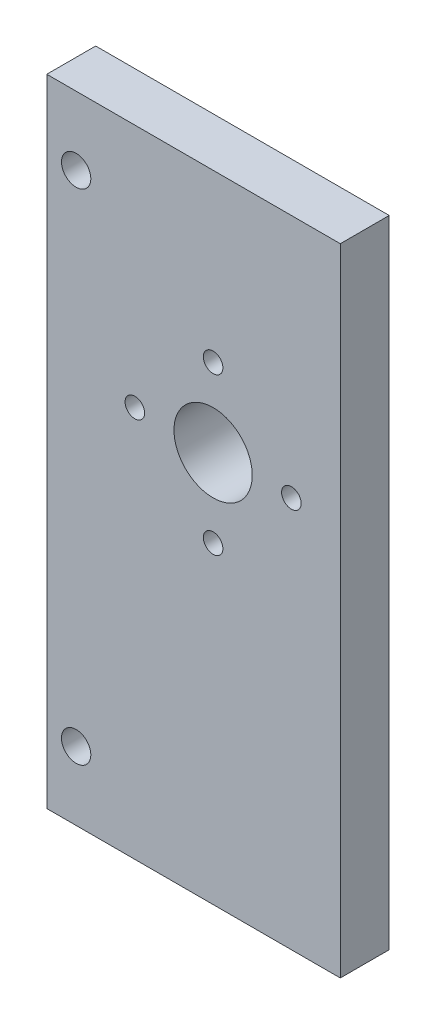
ISO-10303-21;
HEADER;
FILE_DESCRIPTION(('STEP AP214'),'2;1');
FILE_NAME('part.step','',(''),(''),'','','');
FILE_SCHEMA(('AUTOMOTIVE_DESIGN { 1 0 10303 214 1 1 1 1 }'));
ENDSEC;
DATA;
#1=APPLICATION_CONTEXT('core data for automotive mechanical design processes');
#2=APPLICATION_PROTOCOL_DEFINITION('international standard','automotive_design',2000,#1);
#3=PRODUCT_CONTEXT('',#1,'mechanical');
#4=PRODUCT('Part','Part','',(#3));
#5=PRODUCT_RELATED_PRODUCT_CATEGORY('part','',(#4));
#6=PRODUCT_DEFINITION_FORMATION('','',#4);
#7=PRODUCT_DEFINITION_CONTEXT('part definition',#1,'design');
#8=PRODUCT_DEFINITION('design','',#6,#7);
#9=PRODUCT_DEFINITION_SHAPE('','',#8);
#10=(LENGTH_UNIT() NAMED_UNIT(*) SI_UNIT(.MILLI.,.METRE.));
#11=(NAMED_UNIT(*) PLANE_ANGLE_UNIT() SI_UNIT($,.RADIAN.));
#12=(NAMED_UNIT(*) SI_UNIT($,.STERADIAN.) SOLID_ANGLE_UNIT());
#13=UNCERTAINTY_MEASURE_WITH_UNIT(LENGTH_MEASURE(1.E-05),#10,'distance_accuracy_value','');
#14=(GEOMETRIC_REPRESENTATION_CONTEXT(3) GLOBAL_UNCERTAINTY_ASSIGNED_CONTEXT((#13)) GLOBAL_UNIT_ASSIGNED_CONTEXT((#10,
#11,#12)) REPRESENTATION_CONTEXT('',''));
#15=CARTESIAN_POINT('',(0.,0.,0.));
#16=DIRECTION('',(0.,0.,1.));
#17=DIRECTION('',(1.,0.,0.));
#18=AXIS2_PLACEMENT_3D('',#15,#16,#17);
#19=CARTESIAN_POINT('',(0.,0.,0.));
#20=DIRECTION('',(0.,0.,-1.));
#21=DIRECTION('',(-1.,0.,0.));
#22=AXIS2_PLACEMENT_3D('',#19,#20,#21);
#23=PLANE('',#22);
#24=CARTESIAN_POINT('',(42.3645680316484,-75.6707452631833,0.));
#25=DIRECTION('',(0.,0.,1.));
#26=DIRECTION('',(1.,0.,0.));
#27=AXIS2_PLACEMENT_3D('',#24,#25,#26);
#28=CIRCLE('',#27,4.00000000000001);
#29=CARTESIAN_POINT('',(46.3645680316484,-75.6707452631833,0.));
#30=VERTEX_POINT('',#29);
#31=EDGE_CURVE('E122',#30,#30,#28,.T.);
#32=ORIENTED_EDGE('',*,*,#31,.T.);
#33=EDGE_LOOP('',(#32));
#34=FACE_BOUND('',#33,.T.);
#35=CARTESIAN_POINT('',(50.3645680316483,-75.6707452631833,0.));
#36=DIRECTION('',(0.,0.,1.));
#37=DIRECTION('',(1.,0.,0.));
#38=AXIS2_PLACEMENT_3D('',#35,#36,#37);
#39=CIRCLE('',#38,0.999999999999998);
#40=CARTESIAN_POINT('',(51.3645680316483,-75.6707452631833,0.));
#41=VERTEX_POINT('',#40);
#42=EDGE_CURVE('E132',#41,#41,#39,.T.);
#43=ORIENTED_EDGE('',*,*,#42,.T.);
#44=EDGE_LOOP('',(#43));
#45=FACE_BOUND('',#44,.T.);
#46=CARTESIAN_POINT('',(34.3645680316483,-75.6707452631833,0.));
#47=DIRECTION('',(0.,0.,1.));
#48=DIRECTION('',(1.,0.,0.));
#49=AXIS2_PLACEMENT_3D('',#46,#47,#48);
#50=CIRCLE('',#49,0.999999999999998);
#51=CARTESIAN_POINT('',(35.3645680316483,-75.6707452631833,0.));
#52=VERTEX_POINT('',#51);
#53=EDGE_CURVE('E144',#52,#52,#50,.T.);
#54=ORIENTED_EDGE('',*,*,#53,.T.);
#55=EDGE_LOOP('',(#54));
#56=FACE_BOUND('',#55,.T.);
#57=CARTESIAN_POINT('',(42.3645680316484,-67.6707452631833,0.));
#58=DIRECTION('',(0.,0.,1.));
#59=DIRECTION('',(1.,0.,0.));
#60=AXIS2_PLACEMENT_3D('',#57,#58,#59);
#61=CIRCLE('',#60,0.999999999999998);
#62=CARTESIAN_POINT('',(43.3645680316484,-67.6707452631833,0.));
#63=VERTEX_POINT('',#62);
#64=EDGE_CURVE('E138',#63,#63,#61,.T.);
#65=ORIENTED_EDGE('',*,*,#64,.T.);
#66=EDGE_LOOP('',(#65));
#67=FACE_BOUND('',#66,.T.);
#68=CARTESIAN_POINT('',(42.3645680316484,-83.6707452631833,0.));
#69=DIRECTION('',(0.,0.,1.));
#70=DIRECTION('',(1.,0.,0.));
#71=AXIS2_PLACEMENT_3D('',#68,#69,#70);
#72=CIRCLE('',#71,0.999999999999998);
#73=CARTESIAN_POINT('',(43.3645680316484,-83.6707452631833,0.));
#74=VERTEX_POINT('',#73);
#75=EDGE_CURVE('E126',#74,#74,#72,.T.);
#76=ORIENTED_EDGE('',*,*,#75,.T.);
#77=EDGE_LOOP('',(#76));
#78=FACE_BOUND('',#77,.T.);
#79=CARTESIAN_POINT('',(42.3645680316484,-75.6707452631833,0.));
#80=DIRECTION('',(0.,0.,-1.));
#81=DIRECTION('',(-1.,0.,0.));
#82=AXIS2_PLACEMENT_3D('',#79,#80,#81);
#83=CIRCLE('',#82,10.5);
#84=CARTESIAN_POINT('',(31.8645680316484,-75.6707452631833,0.));
#85=VERTEX_POINT('',#84);
#86=EDGE_CURVE('E191',#85,#85,#83,.T.);
#87=ORIENTED_EDGE('',*,*,#86,.T.);
#88=EDGE_LOOP('',(#87));
#89=FACE_BOUND('',#88,.T.);
#90=ADVANCED_FACE('F33',(#34,#45,#56,#67,#78,#89),#23,.T.);
#91=CARTESIAN_POINT('',(55.3645680316484,-115.670745263183,6.));
#92=DIRECTION('',(0.,1.,0.));
#93=DIRECTION('',(-1.,0.,0.));
#94=AXIS2_PLACEMENT_3D('',#91,#92,#93);
#95=PLANE('',#94);
#96=DIRECTION('',(-1.,0.,0.));
#97=VECTOR('',#96,1.);
#98=CARTESIAN_POINT('',(55.3645680316484,-115.670745263183,1.));
#99=LINE('',#98,#97);
#100=CARTESIAN_POINT('',(55.3645680316484,-115.670745263183,1.));
#101=VERTEX_POINT('',#100);
#102=CARTESIAN_POINT('',(25.3645680316484,-115.670745263183,1.));
#103=VERTEX_POINT('',#102);
#104=EDGE_CURVE('E49',#101,#103,#99,.T.);
#105=ORIENTED_EDGE('',*,*,#104,.F.);
#106=DIRECTION('',(0.,0.,-1.));
#107=VECTOR('',#106,1.);
#108=CARTESIAN_POINT('',(55.3645680316484,-115.670745263183,6.));
#109=LINE('',#108,#107);
#110=CARTESIAN_POINT('',(55.3645680316484,-115.670745263183,6.));
#111=VERTEX_POINT('',#110);
#112=EDGE_CURVE('E11',#111,#101,#109,.T.);
#113=ORIENTED_EDGE('',*,*,#112,.F.);
#114=DIRECTION('',(1.,0.,0.));
#115=VECTOR('',#114,1.);
#116=CARTESIAN_POINT('',(55.3645680316484,-115.670745263183,6.));
#117=LINE('',#116,#115);
#118=CARTESIAN_POINT('',(25.3645680316484,-115.670745263183,6.));
#119=VERTEX_POINT('',#118);
#120=EDGE_CURVE('E94',#119,#111,#117,.T.);
#121=ORIENTED_EDGE('',*,*,#120,.F.);
#122=DIRECTION('',(0.,0.,-1.));
#123=VECTOR('',#122,1.);
#124=CARTESIAN_POINT('',(25.3645680316484,-115.670745263183,6.));
#125=LINE('',#124,#123);
#126=EDGE_CURVE('E87',#119,#103,#125,.T.);
#127=ORIENTED_EDGE('',*,*,#126,.T.);
#128=EDGE_LOOP('',(#105,#113,#121,#127));
#129=FACE_BOUND('',#128,.T.);
#130=ADVANCED_FACE('F35',(#129),#95,.F.);
#131=CARTESIAN_POINT('',(55.3645680316484,-50.6707452631833,6.));
#132=DIRECTION('',(-1.,0.,0.));
#133=DIRECTION('',(0.,0.,1.));
#134=AXIS2_PLACEMENT_3D('',#131,#132,#133);
#135=PLANE('',#134);
#136=DIRECTION('',(0.,-1.,0.));
#137=VECTOR('',#136,1.);
#138=CARTESIAN_POINT('',(55.3645680316484,-50.6707452631833,1.));
#139=LINE('',#138,#137);
#140=CARTESIAN_POINT('',(55.3645680316484,-50.6707452631833,1.));
#141=VERTEX_POINT('',#140);
#142=EDGE_CURVE('E74',#141,#101,#139,.T.);
#143=ORIENTED_EDGE('',*,*,#142,.F.);
#144=DIRECTION('',(0.,0.,-1.));
#145=VECTOR('',#144,1.);
#146=CARTESIAN_POINT('',(55.3645680316484,-50.6707452631833,6.));
#147=LINE('',#146,#145);
#148=CARTESIAN_POINT('',(55.3645680316484,-50.6707452631833,6.));
#149=VERTEX_POINT('',#148);
#150=EDGE_CURVE('E42',#149,#141,#147,.T.);
#151=ORIENTED_EDGE('',*,*,#150,.F.);
#152=DIRECTION('',(0.,1.,0.));
#153=VECTOR('',#152,1.);
#154=CARTESIAN_POINT('',(55.3645680316484,-50.6707452631833,6.));
#155=LINE('',#154,#153);
#156=EDGE_CURVE('E91',#111,#149,#155,.T.);
#157=ORIENTED_EDGE('',*,*,#156,.F.);
#158=ORIENTED_EDGE('',*,*,#112,.T.);
#159=EDGE_LOOP('',(#143,#151,#157,#158));
#160=FACE_BOUND('',#159,.T.);
#161=ADVANCED_FACE('F90',(#160),#135,.F.);
#162=CARTESIAN_POINT('',(55.3645680316484,-50.6707452631833,6.));
#163=DIRECTION('',(0.,-1.,0.));
#164=DIRECTION('',(1.,0.,0.));
#165=AXIS2_PLACEMENT_3D('',#162,#163,#164);
#166=PLANE('',#165);
#167=DIRECTION('',(1.,0.,0.));
#168=VECTOR('',#167,1.);
#169=CARTESIAN_POINT('',(55.3645680316484,-50.6707452631833,1.));
#170=LINE('',#169,#168);
#171=CARTESIAN_POINT('',(25.3645680316484,-50.6707452631833,1.));
#172=VERTEX_POINT('',#171);
#173=EDGE_CURVE('E77',#172,#141,#170,.T.);
#174=ORIENTED_EDGE('',*,*,#173,.F.);
#175=DIRECTION('',(0.,0.,-1.));
#176=VECTOR('',#175,1.);
#177=CARTESIAN_POINT('',(25.3645680316484,-50.6707452631833,6.));
#178=LINE('',#177,#176);
#179=CARTESIAN_POINT('',(25.3645680316484,-50.6707452631833,6.));
#180=VERTEX_POINT('',#179);
#181=EDGE_CURVE('E108',#180,#172,#178,.T.);
#182=ORIENTED_EDGE('',*,*,#181,.F.);
#183=DIRECTION('',(-1.,0.,0.));
#184=VECTOR('',#183,1.);
#185=CARTESIAN_POINT('',(55.3645680316484,-50.6707452631833,6.));
#186=LINE('',#185,#184);
#187=EDGE_CURVE('E93',#149,#180,#186,.T.);
#188=ORIENTED_EDGE('',*,*,#187,.F.);
#189=ORIENTED_EDGE('',*,*,#150,.T.);
#190=EDGE_LOOP('',(#174,#182,#188,#189));
#191=FACE_BOUND('',#190,.T.);
#192=ADVANCED_FACE('F112',(#191),#166,.F.);
#193=CARTESIAN_POINT('',(25.3645680316484,-115.670745263183,6.));
#194=DIRECTION('',(1.,0.,0.));
#195=DIRECTION('',(0.,1.,0.));
#196=AXIS2_PLACEMENT_3D('',#193,#194,#195);
#197=PLANE('',#196);
#198=DIRECTION('',(0.,1.,0.));
#199=VECTOR('',#198,1.);
#200=CARTESIAN_POINT('',(25.3645680316484,-50.6707452631833,1.));
#201=LINE('',#200,#199);
#202=EDGE_CURVE('E88',#103,#172,#201,.T.);
#203=ORIENTED_EDGE('',*,*,#202,.F.);
#204=ORIENTED_EDGE('',*,*,#126,.F.);
#205=DIRECTION('',(0.,-1.,0.));
#206=VECTOR('',#205,1.);
#207=CARTESIAN_POINT('',(25.3645680316484,-115.670745263183,6.));
#208=LINE('',#207,#206);
#209=EDGE_CURVE('E57',#180,#119,#208,.T.);
#210=ORIENTED_EDGE('',*,*,#209,.F.);
#211=ORIENTED_EDGE('',*,*,#181,.T.);
#212=EDGE_LOOP('',(#203,#204,#210,#211));
#213=FACE_BOUND('',#212,.T.);
#214=ADVANCED_FACE('F115',(#213),#197,.F.);
#215=CARTESIAN_POINT('',(28.3645680316484,-57.6707452631833,6.));
#216=DIRECTION('',(0.,0.,-1.));
#217=DIRECTION('',(-1.,0.,0.));
#218=AXIS2_PLACEMENT_3D('',#215,#216,#217);
#219=CYLINDRICAL_SURFACE('',#218,1.5);
#220=CARTESIAN_POINT('',(28.3645680316484,-57.6707452631833,6.));
#221=DIRECTION('',(0.,0.,1.));
#222=DIRECTION('',(1.,0.,0.));
#223=AXIS2_PLACEMENT_3D('',#220,#221,#222);
#224=CIRCLE('',#223,1.5);
#225=CARTESIAN_POINT('',(29.8645680316484,-57.6707452631833,6.));
#226=VERTEX_POINT('',#225);
#227=EDGE_CURVE('E98',#226,#226,#224,.T.);
#228=ORIENTED_EDGE('',*,*,#227,.T.);
#229=EDGE_LOOP('',(#228));
#230=FACE_BOUND('',#229,.T.);
#231=CARTESIAN_POINT('',(28.3645680316484,-57.6707452631833,1.));
#232=DIRECTION('',(0.,0.,-1.));
#233=DIRECTION('',(-1.,0.,0.));
#234=AXIS2_PLACEMENT_3D('',#231,#232,#233);
#235=CIRCLE('',#234,1.5);
#236=CARTESIAN_POINT('',(26.8645680316484,-57.6707452631833,1.));
#237=VERTEX_POINT('',#236);
#238=EDGE_CURVE('E119',#237,#237,#235,.T.);
#239=ORIENTED_EDGE('',*,*,#238,.T.);
#240=EDGE_LOOP('',(#239));
#241=FACE_BOUND('',#240,.T.);
#242=ADVANCED_FACE('F226',(#230,#241),#219,.F.);
#243=CARTESIAN_POINT('',(28.3645680316484,-108.670745263183,6.));
#244=DIRECTION('',(0.,0.,-1.));
#245=DIRECTION('',(-1.,0.,0.));
#246=AXIS2_PLACEMENT_3D('',#243,#244,#245);
#247=CYLINDRICAL_SURFACE('',#246,1.5);
#248=CARTESIAN_POINT('',(28.3645680316484,-108.670745263183,6.));
#249=DIRECTION('',(0.,0.,1.));
#250=DIRECTION('',(1.,0.,0.));
#251=AXIS2_PLACEMENT_3D('',#248,#249,#250);
#252=CIRCLE('',#251,1.5);
#253=CARTESIAN_POINT('',(29.8645680316484,-108.670745263183,6.));
#254=VERTEX_POINT('',#253);
#255=EDGE_CURVE('E101',#254,#254,#252,.T.);
#256=ORIENTED_EDGE('',*,*,#255,.T.);
#257=EDGE_LOOP('',(#256));
#258=FACE_BOUND('',#257,.T.);
#259=CARTESIAN_POINT('',(28.3645680316484,-108.670745263183,1.));
#260=DIRECTION('',(0.,0.,-1.));
#261=DIRECTION('',(-1.,0.,0.));
#262=AXIS2_PLACEMENT_3D('',#259,#260,#261);
#263=CIRCLE('',#262,1.5);
#264=CARTESIAN_POINT('',(26.8645680316484,-108.670745263183,1.));
#265=VERTEX_POINT('',#264);
#266=EDGE_CURVE('E37',#265,#265,#263,.T.);
#267=ORIENTED_EDGE('',*,*,#266,.T.);
#268=EDGE_LOOP('',(#267));
#269=FACE_BOUND('',#268,.T.);
#270=ADVANCED_FACE('F154',(#258,#269),#247,.F.);
#271=CARTESIAN_POINT('',(0.,0.,6.));
#272=DIRECTION('',(0.,0.,-1.));
#273=DIRECTION('',(-1.,0.,0.));
#274=AXIS2_PLACEMENT_3D('',#271,#272,#273);
#275=PLANE('',#274);
#276=ORIENTED_EDGE('',*,*,#120,.T.);
#277=ORIENTED_EDGE('',*,*,#156,.T.);
#278=ORIENTED_EDGE('',*,*,#187,.T.);
#279=ORIENTED_EDGE('',*,*,#209,.T.);
#280=EDGE_LOOP('',(#276,#277,#278,#279));
#281=FACE_BOUND('',#280,.T.);
#282=ORIENTED_EDGE('',*,*,#227,.F.);
#283=EDGE_LOOP('',(#282));
#284=FACE_BOUND('',#283,.T.);
#285=ORIENTED_EDGE('',*,*,#255,.F.);
#286=EDGE_LOOP('',(#285));
#287=FACE_BOUND('',#286,.T.);
#288=CARTESIAN_POINT('',(34.3645680316483,-75.6707452631833,6.));
#289=DIRECTION('',(0.,0.,1.));
#290=DIRECTION('',(1.,0.,0.));
#291=AXIS2_PLACEMENT_3D('',#288,#289,#290);
#292=CIRCLE('',#291,0.999999999999998);
#293=CARTESIAN_POINT('',(35.3645680316483,-75.6707452631833,6.));
#294=VERTEX_POINT('',#293);
#295=EDGE_CURVE('E147',#294,#294,#292,.T.);
#296=ORIENTED_EDGE('',*,*,#295,.F.);
#297=EDGE_LOOP('',(#296));
#298=FACE_BOUND('',#297,.T.);
#299=CARTESIAN_POINT('',(42.3645680316484,-67.6707452631833,6.));
#300=DIRECTION('',(0.,0.,1.));
#301=DIRECTION('',(1.,0.,0.));
#302=AXIS2_PLACEMENT_3D('',#299,#300,#301);
#303=CIRCLE('',#302,0.999999999999998);
#304=CARTESIAN_POINT('',(43.3645680316484,-67.6707452631833,6.));
#305=VERTEX_POINT('',#304);
#306=EDGE_CURVE('E141',#305,#305,#303,.T.);
#307=ORIENTED_EDGE('',*,*,#306,.F.);
#308=EDGE_LOOP('',(#307));
#309=FACE_BOUND('',#308,.T.);
#310=CARTESIAN_POINT('',(50.3645680316483,-75.6707452631833,6.));
#311=DIRECTION('',(0.,0.,1.));
#312=DIRECTION('',(1.,0.,0.));
#313=AXIS2_PLACEMENT_3D('',#310,#311,#312);
#314=CIRCLE('',#313,0.999999999999998);
#315=CARTESIAN_POINT('',(51.3645680316483,-75.6707452631833,6.));
#316=VERTEX_POINT('',#315);
#317=EDGE_CURVE('E135',#316,#316,#314,.T.);
#318=ORIENTED_EDGE('',*,*,#317,.F.);
#319=EDGE_LOOP('',(#318));
#320=FACE_BOUND('',#319,.T.);
#321=CARTESIAN_POINT('',(42.3645680316484,-83.6707452631833,6.));
#322=DIRECTION('',(0.,0.,1.));
#323=DIRECTION('',(1.,0.,0.));
#324=AXIS2_PLACEMENT_3D('',#321,#322,#323);
#325=CIRCLE('',#324,0.999999999999998);
#326=CARTESIAN_POINT('',(43.3645680316484,-83.6707452631833,6.));
#327=VERTEX_POINT('',#326);
#328=EDGE_CURVE('E129',#327,#327,#325,.T.);
#329=ORIENTED_EDGE('',*,*,#328,.F.);
#330=EDGE_LOOP('',(#329));
#331=FACE_BOUND('',#330,.T.);
#332=CARTESIAN_POINT('',(42.3645680316484,-75.6707452631833,6.));
#333=DIRECTION('',(0.,0.,1.));
#334=DIRECTION('',(1.,0.,0.));
#335=AXIS2_PLACEMENT_3D('',#332,#333,#334);
#336=CIRCLE('',#335,4.00000000000001);
#337=CARTESIAN_POINT('',(46.3645680316484,-75.6707452631833,6.));
#338=VERTEX_POINT('',#337);
#339=EDGE_CURVE('E123',#338,#338,#336,.T.);
#340=ORIENTED_EDGE('',*,*,#339,.F.);
#341=EDGE_LOOP('',(#340));
#342=FACE_BOUND('',#341,.T.);
#343=ADVANCED_FACE('F96',(#281,#284,#287,#298,#309,#320,#331,#342),#275,.F.);
#344=CARTESIAN_POINT('',(34.3645680316483,-75.6707452631833,6.));
#345=DIRECTION('',(0.,0.,-1.));
#346=DIRECTION('',(-1.,0.,0.));
#347=AXIS2_PLACEMENT_3D('',#344,#345,#346);
#348=CYLINDRICAL_SURFACE('',#347,0.999999999999998);
#349=ORIENTED_EDGE('',*,*,#295,.T.);
#350=EDGE_LOOP('',(#349));
#351=FACE_BOUND('',#350,.T.);
#352=ORIENTED_EDGE('',*,*,#53,.F.);
#353=EDGE_LOOP('',(#352));
#354=FACE_BOUND('',#353,.T.);
#355=ADVANCED_FACE('F159',(#351,#354),#348,.F.);
#356=CARTESIAN_POINT('',(42.3645680316484,-67.6707452631833,6.));
#357=DIRECTION('',(0.,0.,-1.));
#358=DIRECTION('',(-1.,0.,0.));
#359=AXIS2_PLACEMENT_3D('',#356,#357,#358);
#360=CYLINDRICAL_SURFACE('',#359,0.999999999999998);
#361=ORIENTED_EDGE('',*,*,#306,.T.);
#362=EDGE_LOOP('',(#361));
#363=FACE_BOUND('',#362,.T.);
#364=ORIENTED_EDGE('',*,*,#64,.F.);
#365=EDGE_LOOP('',(#364));
#366=FACE_BOUND('',#365,.T.);
#367=ADVANCED_FACE('F216',(#363,#366),#360,.F.);
#368=CARTESIAN_POINT('',(50.3645680316483,-75.6707452631833,6.));
#369=DIRECTION('',(0.,0.,-1.));
#370=DIRECTION('',(-1.,0.,0.));
#371=AXIS2_PLACEMENT_3D('',#368,#369,#370);
#372=CYLINDRICAL_SURFACE('',#371,0.999999999999998);
#373=ORIENTED_EDGE('',*,*,#317,.T.);
#374=EDGE_LOOP('',(#373));
#375=FACE_BOUND('',#374,.T.);
#376=ORIENTED_EDGE('',*,*,#42,.F.);
#377=EDGE_LOOP('',(#376));
#378=FACE_BOUND('',#377,.T.);
#379=ADVANCED_FACE('F212',(#375,#378),#372,.F.);
#380=CARTESIAN_POINT('',(42.3645680316484,-83.6707452631833,6.));
#381=DIRECTION('',(0.,0.,-1.));
#382=DIRECTION('',(-1.,0.,0.));
#383=AXIS2_PLACEMENT_3D('',#380,#381,#382);
#384=CYLINDRICAL_SURFACE('',#383,0.999999999999998);
#385=ORIENTED_EDGE('',*,*,#328,.T.);
#386=EDGE_LOOP('',(#385));
#387=FACE_BOUND('',#386,.T.);
#388=ORIENTED_EDGE('',*,*,#75,.F.);
#389=EDGE_LOOP('',(#388));
#390=FACE_BOUND('',#389,.T.);
#391=ADVANCED_FACE('F174',(#387,#390),#384,.F.);
#392=CARTESIAN_POINT('',(42.3645680316484,-75.6707452631833,6.));
#393=DIRECTION('',(0.,0.,-1.));
#394=DIRECTION('',(-1.,0.,0.));
#395=AXIS2_PLACEMENT_3D('',#392,#393,#394);
#396=CYLINDRICAL_SURFACE('',#395,4.00000000000001);
#397=ORIENTED_EDGE('',*,*,#339,.T.);
#398=EDGE_LOOP('',(#397));
#399=FACE_BOUND('',#398,.T.);
#400=ORIENTED_EDGE('',*,*,#31,.F.);
#401=EDGE_LOOP('',(#400));
#402=FACE_BOUND('',#401,.T.);
#403=ADVANCED_FACE('F171',(#399,#402),#396,.F.);
#404=CARTESIAN_POINT('',(0.,0.,1.));
#405=DIRECTION('',(0.,0.,-1.));
#406=DIRECTION('',(-1.,0.,0.));
#407=AXIS2_PLACEMENT_3D('',#404,#405,#406);
#408=PLANE('',#407);
#409=ORIENTED_EDGE('',*,*,#238,.F.);
#410=EDGE_LOOP('',(#409));
#411=FACE_BOUND('',#410,.T.);
#412=ORIENTED_EDGE('',*,*,#266,.F.);
#413=EDGE_LOOP('',(#412));
#414=FACE_BOUND('',#413,.T.);
#415=CARTESIAN_POINT('',(42.3645680316484,-75.6707452631833,1.));
#416=DIRECTION('',(0.,0.,-1.));
#417=DIRECTION('',(-1.,0.,0.));
#418=AXIS2_PLACEMENT_3D('',#415,#416,#417);
#419=CIRCLE('',#418,10.5);
#420=CARTESIAN_POINT('',(31.8645680316484,-75.6707452631833,1.));
#421=VERTEX_POINT('',#420);
#422=EDGE_CURVE('E81',#421,#421,#419,.T.);
#423=ORIENTED_EDGE('',*,*,#422,.F.);
#424=EDGE_LOOP('',(#423));
#425=FACE_BOUND('',#424,.T.);
#426=ORIENTED_EDGE('',*,*,#142,.T.);
#427=ORIENTED_EDGE('',*,*,#104,.T.);
#428=ORIENTED_EDGE('',*,*,#202,.T.);
#429=ORIENTED_EDGE('',*,*,#173,.T.);
#430=EDGE_LOOP('',(#426,#427,#428,#429));
#431=FACE_BOUND('',#430,.T.);
#432=ADVANCED_FACE('F75',(#411,#414,#425,#431),#408,.T.);
#433=CARTESIAN_POINT('',(42.3645680316484,-75.6707452631833,1.));
#434=DIRECTION('',(0.,0.,-1.));
#435=DIRECTION('',(-1.,0.,0.));
#436=AXIS2_PLACEMENT_3D('',#433,#434,#435);
#437=CYLINDRICAL_SURFACE('',#436,10.5);
#438=ORIENTED_EDGE('',*,*,#422,.T.);
#439=EDGE_LOOP('',(#438));
#440=FACE_BOUND('',#439,.T.);
#441=ORIENTED_EDGE('',*,*,#86,.F.);
#442=EDGE_LOOP('',(#441));
#443=FACE_BOUND('',#442,.T.);
#444=ADVANCED_FACE('F198',(#440,#443),#437,.T.);
#445=CLOSED_SHELL('',(#90,#130,#161,#192,#214,#242,#270,#343,#355,#367,#379,#391,#403,#432,#444));
#446=MANIFOLD_SOLID_BREP('B2',#445);
#447=ADVANCED_BREP_SHAPE_REPRESENTATION('',(#18,#446),#14);
#448=SHAPE_DEFINITION_REPRESENTATION(#9,#447);
ENDSEC;
END-ISO-10303-21;
